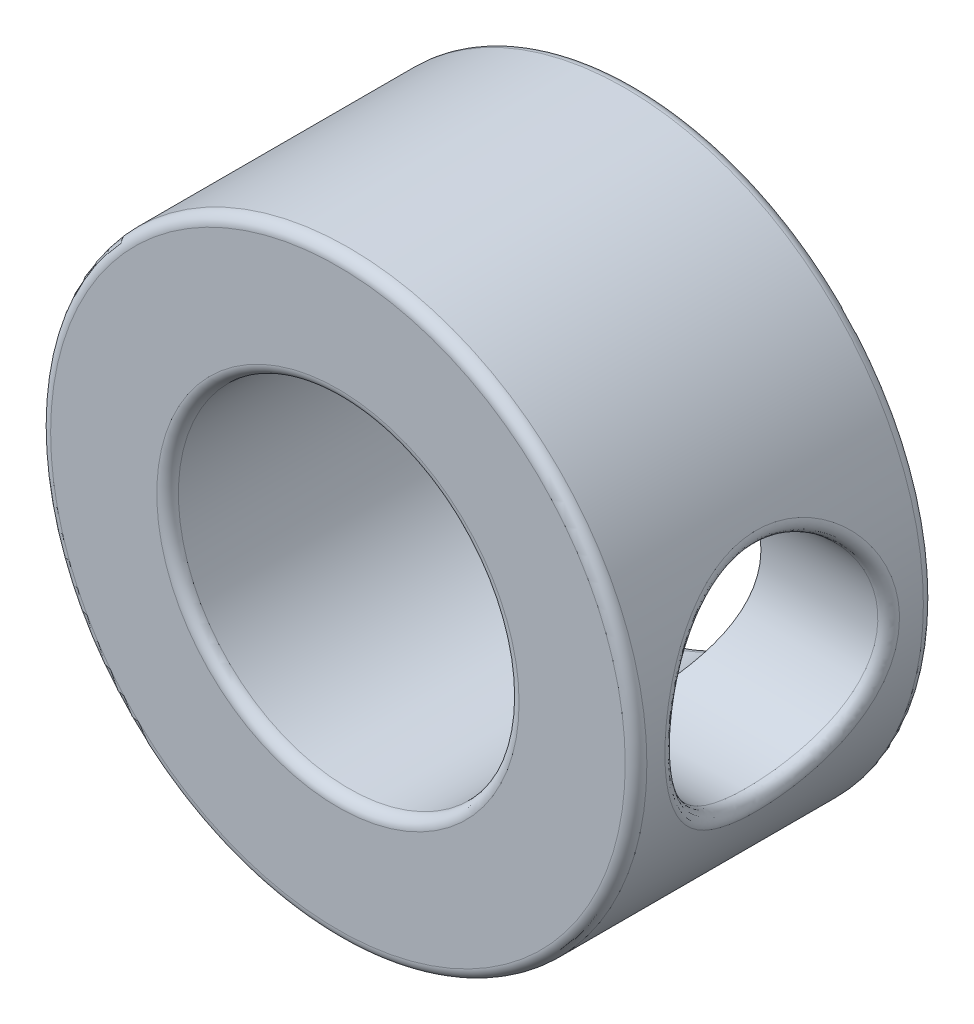
ISO-10303-21;
HEADER;
FILE_DESCRIPTION(('STEP AP214'),'2;1');
FILE_NAME('part.step','',(''),(''),'','','');
FILE_SCHEMA(('AUTOMOTIVE_DESIGN { 1 0 10303 214 1 1 1 1 }'));
ENDSEC;
DATA;
#1=APPLICATION_CONTEXT('core data for automotive mechanical design processes');
#2=APPLICATION_PROTOCOL_DEFINITION('international standard','automotive_design',2000,#1);
#3=PRODUCT_CONTEXT('',#1,'mechanical');
#4=PRODUCT('Part','Part','',(#3));
#5=PRODUCT_RELATED_PRODUCT_CATEGORY('part','',(#4));
#6=PRODUCT_DEFINITION_FORMATION('','',#4);
#7=PRODUCT_DEFINITION_CONTEXT('part definition',#1,'design');
#8=PRODUCT_DEFINITION('design','',#6,#7);
#9=PRODUCT_DEFINITION_SHAPE('','',#8);
#10=(LENGTH_UNIT() NAMED_UNIT(*) SI_UNIT(.MILLI.,.METRE.));
#11=(NAMED_UNIT(*) PLANE_ANGLE_UNIT() SI_UNIT($,.RADIAN.));
#12=(NAMED_UNIT(*) SI_UNIT($,.STERADIAN.) SOLID_ANGLE_UNIT());
#13=UNCERTAINTY_MEASURE_WITH_UNIT(LENGTH_MEASURE(1.E-05),#10,'distance_accuracy_value','');
#14=(GEOMETRIC_REPRESENTATION_CONTEXT(3) GLOBAL_UNCERTAINTY_ASSIGNED_CONTEXT((#13)) GLOBAL_UNIT_ASSIGNED_CONTEXT((#10,
#11,#12)) REPRESENTATION_CONTEXT('',''));
#15=CARTESIAN_POINT('',(0.,0.,0.));
#16=DIRECTION('',(0.,0.,1.));
#17=DIRECTION('',(1.,0.,0.));
#18=AXIS2_PLACEMENT_3D('',#15,#16,#17);
#19=CARTESIAN_POINT('',(0.,0.,7.));
#20=DIRECTION('',(0.,0.,-1.));
#21=DIRECTION('',(-1.,0.,0.));
#22=AXIS2_PLACEMENT_3D('',#19,#20,#21);
#23=CYLINDRICAL_SURFACE('',#22,7.);
#24=CARTESIAN_POINT('',(0.,0.,0.254));
#25=DIRECTION('',(0.,0.,1.));
#26=DIRECTION('',(1.,0.,0.));
#27=AXIS2_PLACEMENT_3D('',#24,#25,#26);
#28=CIRCLE('',#27,7.);
#29=CARTESIAN_POINT('',(7.,0.,0.254));
#30=VERTEX_POINT('',#29);
#31=EDGE_CURVE('E55',#30,#30,#28,.T.);
#32=ORIENTED_EDGE('',*,*,#31,.T.);
#33=EDGE_LOOP('',(#32));
#34=FACE_BOUND('',#33,.T.);
#35=CARTESIAN_POINT('',(6.74599500718785,-0.00745052319217011,6.06868885091597));
#36=CARTESIAN_POINT('',(6.99999574017009,-0.00775954974410198,6.06868792994807));
#37=CARTESIAN_POINT('',(6.99999481919878,-0.00851652453884966,6.32268772294422));
#38=CARTESIAN_POINT('',(6.74617475967984,0.124835557051628,6.06908603325106));
#39=CARTESIAN_POINT('',(7.00015029726477,0.129996553392197,6.06912102237102));
#40=CARTESIAN_POINT('',(7.00018133973748,0.142696701630731,6.3231252590001));
#41=CARTESIAN_POINT('',(6.74158726593411,0.257138676457775,6.05894232636427));
#42=CARTESIAN_POINT('',(6.99620204426195,0.268263544874281,6.05805018324804));
#43=CARTESIAN_POINT('',(6.99542111789747,0.293929404881043,6.31195095148874));
#44=CARTESIAN_POINT('',(6.72336696868249,0.51796736376721,6.01801328992543));
#45=CARTESIAN_POINT('',(6.98070532023795,0.539434260967655,6.01378548108198));
#46=CARTESIAN_POINT('',(6.97651479107329,0.592076777707847,6.2668635248723));
#47=CARTESIAN_POINT('',(6.70973425932946,0.646492970976585,5.98722817523252));
#48=CARTESIAN_POINT('',(6.96905385138901,0.673211414765891,5.9802946376337));
#49=CARTESIAN_POINT('',(6.96236878378703,0.738991492214241,6.23295064245604));
#50=CARTESIAN_POINT('',(6.67488718618503,0.895641365868597,5.90641205385684));
#51=CARTESIAN_POINT('',(6.93969470639737,0.930822749563901,5.89325259534693));
#52=CARTESIAN_POINT('',(6.92620965063367,1.0237873869586,6.1439236029936));
#53=CARTESIAN_POINT('',(6.65371315904884,1.0163022341838,5.85648333489822));
#54=CARTESIAN_POINT('',(6.92185087117704,1.05535651916526,5.83928119657562));
#55=CARTESIAN_POINT('',(6.90423838017585,1.16171209630641,6.08892212610444));
#56=CARTESIAN_POINT('',(6.6057714185031,1.24769503560081,5.73897851180741));
#57=CARTESIAN_POINT('',(6.88211239867013,1.29232379734476,5.7136332367024));
#58=CARTESIAN_POINT('',(6.85449154014115,1.42621197381462,5.95947881276385));
#59=CARTESIAN_POINT('',(6.57900217679618,1.35842424409875,5.67139758482478));
#60=CARTESIAN_POINT('',(6.86004485319853,1.4050874357702,5.64131528531973));
#61=CARTESIAN_POINT('',(6.82671438472362,1.55278402754198,5.88503166346038));
#62=CARTESIAN_POINT('',(6.5205215210907,1.57419408066983,5.51567064642374));
#63=CARTESIAN_POINT('',(6.81271803529845,1.62297603822272,5.47655206606691));
#64=CARTESIAN_POINT('',(6.76603181822603,1.7994256470997,5.71348286781811));
#65=CARTESIAN_POINT('',(6.48860662258537,1.67845672308211,5.42650960014164));
#66=CARTESIAN_POINT('',(6.78724795362709,1.72702345494025,5.38254609222411));
#67=CARTESIAN_POINT('',(6.73291526099035,1.91860591510053,5.6152630590727));
#68=CARTESIAN_POINT('',(6.42438106198946,1.87100876780006,5.23243747361491));
#69=CARTESIAN_POINT('',(6.73717149168276,1.91705858818845,5.18089223688708));
#70=CARTESIAN_POINT('',(6.6662714833269,2.13870780212069,5.40147320412166));
#71=CARTESIAN_POINT('',(6.39207032568824,1.959295124427,5.12752339721305));
#72=CARTESIAN_POINT('',(6.71256141759241,2.00262980438805,5.0727308721005));
#73=CARTESIAN_POINT('',(6.63274418589464,2.23962593969365,5.28589985734921));
#74=CARTESIAN_POINT('',(6.32889385178657,2.1217524317245,4.89866429381252));
#75=CARTESIAN_POINT('',(6.66560180273846,2.15834307381071,4.84036127620799));
#76=CARTESIAN_POINT('',(6.56718899560713,2.42532721322455,5.03378866860229));
#77=CARTESIAN_POINT('',(6.29817739564418,2.19501531889687,4.77403695059395));
#78=CARTESIAN_POINT('',(6.64362419557387,2.22658487236328,4.71570405049089));
#79=CARTESIAN_POINT('',(6.53531600488906,2.50907236231971,4.89649918707927));
#80=CARTESIAN_POINT('',(6.24388924712907,2.31931825672073,4.51296567506265));
#81=CARTESIAN_POINT('',(6.60569010857351,2.34119239282023,4.45884047450859));
#82=CARTESIAN_POINT('',(6.47898380199066,2.65116023890917,4.60890306945685));
#83=CARTESIAN_POINT('',(6.22031437578095,2.37036819957907,4.37652703526003));
#84=CARTESIAN_POINT('',(6.59002471989581,2.38657651134753,4.32726568521363));
#85=CARTESIAN_POINT('',(6.45452129114008,2.70951427396128,4.45860226358661));
#86=CARTESIAN_POINT('',(6.18443495506598,2.44648660381233,4.10174893341213));
#87=CARTESIAN_POINT('',(6.56646973377402,2.45406169565333,4.06538174986361));
#88=CARTESIAN_POINT('',(6.41729094068764,2.79652350017296,4.15590670606387));
#89=CARTESIAN_POINT('',(6.17169115057216,2.47257372249908,3.96374086415235));
#90=CARTESIAN_POINT('',(6.55851676118021,2.47636827780138,3.93639698656297));
#91=CARTESIAN_POINT('',(6.40406730716027,2.82634309546813,4.00387701670436));
#92=CARTESIAN_POINT('',(6.15766921177718,2.50122485455607,3.68486046772902));
#93=CARTESIAN_POINT('',(6.54967575846336,2.50114505644535,3.67598561658126));
#94=CARTESIAN_POINT('',(6.38951741511152,2.85909355645748,3.69666237147258));
#95=CARTESIAN_POINT('',(6.15638468851681,2.50380197560913,3.54398978049621));
#96=CARTESIAN_POINT('',(6.54889559300078,2.50331269470183,3.54620428905899));
#97=CARTESIAN_POINT('',(6.38818452707417,2.86203940524739,3.54147922214803));
#98=CARTESIAN_POINT('',(6.1651070380662,2.48603935445717,3.2746787343628));
#99=CARTESIAN_POINT('',(6.55437547449423,2.48798274806516,3.29526602006163));
#100=CARTESIAN_POINT('',(6.39723529001491,2.841735354777,3.2448061732119));
#101=CARTESIAN_POINT('',(6.1742743784216,2.46740368417212,3.14609842257639));
#102=CARTESIAN_POINT('',(6.56005216042953,2.47211484934405,3.17562681530749));
#103=CARTESIAN_POINT('',(6.4067477985146,2.8204333415852,3.10316210150116));
#104=CARTESIAN_POINT('',(6.20138390650727,2.41072447929529,2.89409390223644));
#105=CARTESIAN_POINT('',(6.57758781055965,2.42231644182766,2.9371742612308));
#106=CARTESIAN_POINT('',(6.43487805302736,2.75564462452112,2.8255539214169));
#107=CARTESIAN_POINT('',(6.21932758337659,2.37267765103672,2.7706705725611));
#108=CARTESIAN_POINT('',(6.58927757185712,2.38887370377212,2.81944326096926));
#109=CARTESIAN_POINT('',(6.45349734424847,2.71215415573282,2.68959078121563));
#110=CARTESIAN_POINT('',(6.26222723364642,2.27780627372992,2.53015586629475));
#111=CARTESIAN_POINT('',(6.61849348003791,2.30280261946681,2.58586322850734));
#112=CARTESIAN_POINT('',(6.49801224945904,2.60370883016066,2.42463978031987));
#113=CARTESIAN_POINT('',(6.28728606495165,2.22070395816155,2.41318990153409));
#114=CARTESIAN_POINT('',(6.63589035507322,2.25056918971535,2.47070456879037));
#115=CARTESIAN_POINT('',(6.52401459414781,2.53843646474901,2.29579007329759));
#116=CARTESIAN_POINT('',(6.3416585099399,2.08942092923613,2.18988126567253));
#117=CARTESIAN_POINT('',(6.67510160460914,2.1271223426441,2.24745348401034));
#118=CARTESIAN_POINT('',(6.58043426728775,2.38836980384995,2.04979327961299));
#119=CARTESIAN_POINT('',(6.37098096087515,2.01520455145277,2.08356145337705));
#120=CARTESIAN_POINT('',(6.69674840371695,2.05655735327754,2.1395475499105));
#121=CARTESIAN_POINT('',(6.61086076573207,2.30353474116384,1.93267137421085));
#122=CARTESIAN_POINT('',(6.43343249771855,1.84480773973347,1.87572392768188));
#123=CARTESIAN_POINT('',(6.74411825987406,1.8912921744444,1.92659638429398));
#124=CARTESIAN_POINT('',(6.67566372436518,2.10875799993064,1.70371755549261));
#125=CARTESIAN_POINT('',(6.46667761147503,1.74733594364443,1.77529099385522));
#126=CARTESIAN_POINT('',(6.7699990339024,1.79552738530894,1.82194128843529));
#127=CARTESIAN_POINT('',(6.71016058103963,1.99734019450898,1.59308063535066));
#128=CARTESIAN_POINT('',(6.53119381084308,1.53691236177982,1.59200129199734));
#129=CARTESIAN_POINT('',(6.8211957011239,1.58560315000032,1.6298738203169));
#130=CARTESIAN_POINT('',(6.77710594054297,1.75680975759809,1.3911686994337));
#131=CARTESIAN_POINT('',(6.5624681942855,1.42398749721672,1.50911458216153));
#132=CARTESIAN_POINT('',(6.84658403266685,1.47173295808384,1.54176157863926));
#133=CARTESIAN_POINT('',(6.80955786537196,1.62772789913789,1.29986069976655));
#134=CARTESIAN_POINT('',(6.62061378808573,1.18187117689607,1.36102488677929));
#135=CARTESIAN_POINT('',(6.89421870321587,1.22552771362536,1.38427664388087));
#136=CARTESIAN_POINT('',(6.86989275375105,1.35097020976519,1.13672509106809));
#137=CARTESIAN_POINT('',(6.64734657699712,1.05232834001264,1.29634790721505));
#138=CARTESIAN_POINT('',(6.91658186689089,1.09248734208336,1.31454214264466));
#139=CARTESIAN_POINT('',(6.89763208401371,1.2028927230358,1.06547693022575));
#140=CARTESIAN_POINT('',(6.69231708846353,0.782948669364743,1.19005678385437));
#141=CARTESIAN_POINT('',(6.95425779269201,0.814861516780464,1.20034172997105));
#142=CARTESIAN_POINT('',(6.9442958225435,0.894970914572305,0.94838662852038));
#143=CARTESIAN_POINT('',(6.71055666020419,0.643114084056474,1.14843761942041));
#144=CARTESIAN_POINT('',(6.96981502692394,0.669556407186583,1.15506838439948));
#145=CARTESIAN_POINT('',(6.9632221496217,0.735129162997615,0.902538956923043));
#146=CARTESIAN_POINT('',(6.73680606862785,0.352345857007659,1.0890557805385));
#147=CARTESIAN_POINT('',(6.99208697380478,0.367666681358566,1.09092315209673));
#148=CARTESIAN_POINT('',(6.99045989927056,0.402758579493246,0.837123923112755));
#149=CARTESIAN_POINT('',(6.74442405099234,0.201193879740451,1.07220575108179));
#150=CARTESIAN_POINT('',(6.99865558220449,0.209596000722869,1.07249675320338));
#151=CARTESIAN_POINT('',(6.99836471344446,0.229980173161718,0.818561930622809));
#152=CARTESIAN_POINT('',(6.74713114913899,-0.101743124872872,1.06618348574021));
#153=CARTESIAN_POINT('',(7.00096379225252,-0.105866174321291,1.06597773119444));
#154=CARTESIAN_POINT('',(7.00117373909926,-0.116300264732359,0.811927803109246));
#155=CARTESIAN_POINT('',(6.74222234682324,-0.253528042840974,1.0770066506804));
#156=CARTESIAN_POINT('',(6.9967263461177,-0.264692286702364,1.07782057273768));
#157=CARTESIAN_POINT('',(6.99608011086989,-0.289802171267377,0.823850601634511));
#158=CARTESIAN_POINT('',(6.72149200529628,-0.53922248002936,1.12362269747624));
#159=CARTESIAN_POINT('',(6.97911064896531,-0.561575115806109,1.12820060070728));
#160=CARTESIAN_POINT('',(6.97456923168135,-0.616373020336436,0.875202838865574));
#161=CARTESIAN_POINT('',(6.70663076600897,-0.673556609111092,1.15722122940782));
#162=CARTESIAN_POINT('',(6.966405197191,-0.701387957401834,1.1647722600233));
#163=CARTESIAN_POINT('',(6.95914843781121,-0.769927324799997,0.912214981692579));
#164=CARTESIAN_POINT('',(6.66864849181504,-0.933983941615437,1.24564474518678));
#165=CARTESIAN_POINT('',(6.93443904659647,-0.970491715946302,1.25996639981521));
#166=CARTESIAN_POINT('',(6.9197360573646,-1.0676159180523,1.0096223268494));
#167=CARTESIAN_POINT('',(6.64552756784622,-1.0600772556955,1.30046944394127));
#168=CARTESIAN_POINT('',(6.914979594771,-1.10050362248234,1.31921741678887));
#169=CARTESIAN_POINT('',(6.89574458590295,-1.21175033333107,1.0700172151209));
#170=CARTESIAN_POINT('',(6.59350314529423,-1.30049784567915,1.42924586703551));
#171=CARTESIAN_POINT('',(6.87198675319146,-1.34628099732105,1.45672817065633));
#172=CARTESIAN_POINT('',(6.84176134234895,-1.48656967160273,1.21187732303211));
#173=CARTESIAN_POINT('',(6.56461537865591,-1.41485587765908,1.50314571167821));
#174=CARTESIAN_POINT('',(6.84826886723279,-1.46242403260547,1.5356858603471));
#175=CARTESIAN_POINT('',(6.81178589454203,-1.61728975117129,1.29328539199761));
#176=CARTESIAN_POINT('',(6.50386918277736,-1.6297332580478,1.66808786962075));
#177=CARTESIAN_POINT('',(6.79942102240268,-1.67851696995995,1.70961256693629));
#178=CARTESIAN_POINT('',(6.74875248643571,-1.86291122442291,1.4749856735007));
#179=CARTESIAN_POINT('',(6.47200983119502,-1.73024828562901,1.75913551437678));
#180=CARTESIAN_POINT('',(6.77417752867175,-1.77838176646607,1.8052733264754));
#181=CARTESIAN_POINT('',(6.71569356906665,-1.97780767906576,1.57528375917045));
#182=CARTESIAN_POINT('',(6.40692715623243,-1.91974255808199,1.96101302947507));
#183=CARTESIAN_POINT('',(6.72377492933634,-1.96467319653937,2.01442378440226));
#184=CARTESIAN_POINT('',(6.64816040544583,-2.19441429585879,1.79767203021002));
#185=CARTESIAN_POINT('',(6.3737115393448,-2.00793933969999,2.07258118960323));
#186=CARTESIAN_POINT('',(6.69873676178252,-2.04958136549647,2.12889556227904));
#187=CARTESIAN_POINT('',(6.6136941558066,-2.29523004195191,1.92057551560724));
#188=CARTESIAN_POINT('',(6.31121660355488,-2.16451424582333,2.3097089874714));
#189=CARTESIAN_POINT('',(6.65283301328839,-2.19851007459131,2.36814806967412));
#190=CARTESIAN_POINT('',(6.54884616418871,-2.47420727557035,2.18179549818504));
#191=CARTESIAN_POINT('',(6.28193737406169,-2.23289192020839,2.43526894289545));
#192=CARTESIAN_POINT('',(6.63216245935035,-2.26167202387703,2.49289731944324));
#193=CARTESIAN_POINT('',(6.51846451498557,-2.55236824857337,2.32011234532636));
#194=CARTESIAN_POINT('',(6.23103621669934,-2.34748780118054,2.69710717196087));
#195=CARTESIAN_POINT('',(6.59701542948907,-2.3665454987018,2.74897711201861));
#196=CARTESIAN_POINT('',(6.46564683030446,-2.6833602081145,2.60855333896961));
#197=CARTESIAN_POINT('',(6.20940072269675,-2.39374531884327,2.83336592644063));
#198=CARTESIAN_POINT('',(6.58281808329075,-2.40735038831789,2.87955884834043));
#199=CARTESIAN_POINT('',(6.44319671790211,-2.73623613025407,2.75865598316308));
#200=CARTESIAN_POINT('',(6.17680669023856,-2.46226949879942,3.11276617530863));
#201=CARTESIAN_POINT('',(6.56160268984373,-2.46779098665268,3.14470547801618));
#202=CARTESIAN_POINT('',(6.40937545680101,-2.81456457041803,3.06644329784849));
#203=CARTESIAN_POINT('',(6.1658398427226,-2.48455483277816,3.25590222212774));
#204=CARTESIAN_POINT('',(6.55482818826294,-2.48672059387889,3.2778314813607));
#205=CARTESIAN_POINT('',(6.39799568618961,-2.84003843162355,3.22412196729825));
#206=CARTESIAN_POINT('',(6.15663637645881,-2.50328253732633,3.53277789844078));
#207=CARTESIAN_POINT('',(6.54905898419359,-2.50285154820035,3.53575300032179));
#208=CARTESIAN_POINT('',(6.38844569155543,-2.86144564709561,3.52912821285393));
#209=CARTESIAN_POINT('',(6.15746182032483,-2.50162882666783,3.66636569872854));
#210=CARTESIAN_POINT('',(6.54955890352849,-2.50146421399662,3.65892197151308));
#211=CARTESIAN_POINT('',(6.38930221498354,-2.85955532784634,3.67628853390606));
#212=CARTESIAN_POINT('',(6.16945792639263,-2.47715220828366,3.93118478341383));
#213=CARTESIAN_POINT('',(6.55710748456049,-2.48032593460818,3.906008800048));
#214=CARTESIAN_POINT('',(6.40174999773839,-2.8315766590032,3.96801323810089));
#215=CARTESIAN_POINT('',(6.18062825838362,-2.45432997626116,4.0624161428931));
#216=CARTESIAN_POINT('',(6.56406952546413,-2.46081772100361,4.02851245938795));
#217=CARTESIAN_POINT('',(6.41334091442127,-2.80548908179035,4.11257770395363));
#218=CARTESIAN_POINT('',(6.21137842948889,-2.38947746672735,4.3149607637743));
#219=CARTESIAN_POINT('',(6.58414743753973,-2.40349709288754,4.26862118448744));
#220=CARTESIAN_POINT('',(6.44524888918199,-2.73135764503108,4.39078085879962));
#221=CARTESIAN_POINT('',(6.23070077872768,-2.34803298141482,4.43645233007953));
#222=CARTESIAN_POINT('',(6.59688611147592,-2.36679415624031,4.3851955590031));
#223=CARTESIAN_POINT('',(6.46529876239056,-2.68398339129713,4.52461596847466));
#224=CARTESIAN_POINT('',(6.27554992925054,-2.24745222354262,4.67110372734068));
#225=CARTESIAN_POINT('',(6.62776095268466,-2.27492135550501,4.61435480586855));
#226=CARTESIAN_POINT('',(6.51183657052488,-2.56901180198957,4.7831079481426));
#227=CARTESIAN_POINT('',(6.30108899594309,-2.18828092255966,4.78424650412065));
#228=CARTESIAN_POINT('',(6.64570008532348,-2.22038733666388,4.72638428846945));
#229=CARTESIAN_POINT('',(6.53833723267558,-2.5013744262176,4.90774603125523));
#230=CARTESIAN_POINT('',(6.35762857067482,-2.04926340574625,5.00707361361344));
#231=CARTESIAN_POINT('',(6.68682546350685,-2.08901115510839,4.95001509200657));
#232=CARTESIAN_POINT('',(6.59700563218115,-2.34246664717305,5.15321237551024));
#233=CARTESIAN_POINT('',(6.38888260475161,-1.96828337366651,5.11599731334543));
#234=CARTESIAN_POINT('',(6.71014376359452,-2.01152447674513,5.06117178252428));
#235=CARTESIAN_POINT('',(6.62943644132025,-2.24990020419283,5.27320272336092));
#236=CARTESIAN_POINT('',(6.45217329066093,-1.7900781395532,5.31908639048794));
#237=CARTESIAN_POINT('',(6.75867198592182,-1.83745101981034,5.27048416258287));
#238=CARTESIAN_POINT('',(6.69511014446286,-2.04619783187104,5.49692565112569));
#239=CARTESIAN_POINT('',(6.48420877137918,-1.69287610799422,5.41327245162152));
#240=CARTESIAN_POINT('',(6.7838269436578,-1.74141831916768,5.36901605604669));
#241=CARTESIAN_POINT('',(6.72835182325732,-1.93508838817493,5.60068101622921));
#242=CARTESIAN_POINT('',(6.54785199975865,-1.47776578689924,5.5902749874807));
#243=CARTESIAN_POINT('',(6.83460843186344,-1.52617138737495,5.55489888302549));
#244=CARTESIAN_POINT('',(6.79439134276142,-1.68920064566645,5.79566701007047));
#245=CARTESIAN_POINT('',(6.5793136127306,-1.35895439860301,5.67204303084143));
#246=CARTESIAN_POINT('',(6.86031405996092,-1.40590587895464,5.64210306841292));
#247=CARTESIAN_POINT('',(6.827037546524,-1.55339003508995,5.88574268681738));
#248=CARTESIAN_POINT('',(6.6361333172484,-1.10811576806966,5.81432970536513));
#249=CARTESIAN_POINT('',(6.90710778928188,-1.14999419702859,5.79380528558049));
#250=CARTESIAN_POINT('',(6.88599662326902,-1.26666207020738,6.04248568774292));
#251=CARTESIAN_POINT('',(6.6614929193477,-0.976091808088085,5.8748535972255));
#252=CARTESIAN_POINT('',(6.92841931523944,-1.01402873138421,5.85919949670314));
#253=CARTESIAN_POINT('',(6.91231106368015,-1.11574846777339,6.10915880710581));
#254=CARTESIAN_POINT('',(6.70253869622148,-0.706775356303272,5.9708346683698));
#255=CARTESIAN_POINT('',(6.96292550453562,-0.735886343765747,5.96249430137413));
#256=CARTESIAN_POINT('',(6.9549022937152,-0.807898923355595,6.2148915552671));
#257=CARTESIAN_POINT('',(6.71850364139775,-0.569778514294474,6.00701934286501));
#258=CARTESIAN_POINT('',(6.9765667736721,-0.593353670941076,6.00187653307826));
#259=CARTESIAN_POINT('',(6.97146834999219,-0.651300931964338,6.25475259278984));
#260=CARTESIAN_POINT('',(6.74013288521395,-0.291009529436165,6.05572765269276));
#261=CARTESIAN_POINT('',(6.99494714884321,-0.303652518962027,6.05453269465991));
#262=CARTESIAN_POINT('',(6.99391197684194,-0.332646410802204,6.30840966699057));
#263=CARTESIAN_POINT('',(6.74580234157784,-0.14923981392762,6.06826313566702));
#264=CARTESIAN_POINT('',(6.99983005758946,-0.155431752779112,6.06822366222592));
#265=CARTESIAN_POINT('',(6.99979489933691,-0.170592655669881,6.32221875503073));
#266=CARTESIAN_POINT('',(6.74599500718785,-0.00745052319217011,6.06868885091597));
#267=CARTESIAN_POINT('',(6.99999574017009,-0.00775954974410198,6.06868792994807));
#268=CARTESIAN_POINT('',(6.99999481919878,-0.00851652453884966,6.32268772294422));
#269=(BOUNDED_SURFACE() B_SPLINE_SURFACE(3,2,((#35,#36,#37),(#38,#39,#40),(#41,#42,#43),(#44,
#45,#46),(#47,#48,#49),(#50,#51,#52),(#53,#54,#55),(#56,#57,#58),(#59,#60,#61),(#62,#63,#64),
(#65,#66,#67),(#68,#69,#70),(#71,#72,#73),(#74,#75,#76),(#77,#78,#79),(#80,#81,#82),(#83,#84,
#85),(#86,#87,#88),(#89,#90,#91),(#92,#93,#94),(#95,#96,#97),(#98,#99,#100),(#101,#102,#103),
(#104,#105,#106),(#107,#108,#109),(#110,#111,#112),(#113,#114,#115),(#116,#117,#118),(#119,#120,
#121),(#122,#123,#124),(#125,#126,#127),(#128,#129,#130),(#131,#132,#133),(#134,#135,#136),
(#137,#138,#139),(#140,#141,#142),(#143,#144,#145),(#146,#147,#148),(#149,#150,#151),(#152,#153,
#154),(#155,#156,#157),(#158,#159,#160),(#161,#162,#163),(#164,#165,#166),(#167,#168,#169),
(#170,#171,#172),(#173,#174,#175),(#176,#177,#178),(#179,#180,#181),(#182,#183,#184),(#185,#186,
#187),(#188,#189,#190),(#191,#192,#193),(#194,#195,#196),(#197,#198,#199),(#200,#201,#202),
(#203,#204,#205),(#206,#207,#208),(#209,#210,#211),(#212,#213,#214),(#215,#216,#217),(#218,#219,
#220),(#221,#222,#223),(#224,#225,#226),(#227,#228,#229),(#230,#231,#232),(#233,#234,#235),
(#236,#237,#238),(#239,#240,#241),(#242,#243,#244),(#245,#246,#247),(#248,#249,#250),(#251,#252,
#253),(#254,#255,#256),(#257,#258,#259),(#260,#261,#262),(#263,#264,#265),(#266,#267,#268)),
.UNSPECIFIED.,.T.,.F.,.F.) B_SPLINE_SURFACE_WITH_KNOTS((4,2,2,2,2,2,2,2,2,2,2,2,2,2,2,2,2,2,2,2,
2,2,2,2,2,2,2,2,2,2,2,2,2,2,2,2,2,2,4),(3,3),(0.,0.436616810043615,0.873229075355682,
1.30754024050505,1.74197019038331,2.20332697972452,2.6647716285144,3.14891684545277,
3.63284623424639,4.09605974524803,4.55901498199568,4.98725261406854,5.415562933273,
5.85041117348327,6.28617392787169,6.75719873633258,7.22741316561278,7.71007081162142,
8.19262332180471,8.69254543860062,9.19238447572818,9.64985416661589,10.10731771335,
10.5635499463519,11.0199242622801,11.4981433065655,11.9763732110389,12.4537500361167,
12.9307547675031,13.3700460472666,13.8093233052526,14.2356569769021,14.6628387093622,
15.1191205922529,15.5747562430553,16.0582737001037,16.5416713389272,17.0098885967449,
17.4778712273071),(0.,1.),
.UNSPECIFIED.) GEOMETRIC_REPRESENTATION_ITEM() RATIONAL_B_SPLINE_SURFACE(((1.,0.70710549924999,
1.),(1.,0.707151568530498,1.),(1.,0.705975624734945,1.),(1.,0.701283628903925,1.),(1.,
0.697767601226703,1.),(1.,0.688713643561791,1.),(1.,0.683186467373548,1.),(1.,0.670548544346412,
1.),(1.,0.663437364812117,1.),(1.,0.647715924673652,1.),(1.,0.639040067527608,1.),(1.,
0.621330679623231,1.),(1.,0.612297081065213,1.),(1.,0.594376364174896,1.),(1.,0.585518314131266,
1.),(1.,0.569656233245094,1.),(1.,0.562651377655683,1.),(1.,0.551904461755357,1.),(1.,
0.548035565219873,1.),(1.,0.543775285565567,1.),(1.,0.543381964690145,1.),(1.,0.546035672268308,
1.),(1.,0.548826916445673,1.),(1.,0.556991158361137,1.),(1.,0.562364594234069,1.),(1.,
0.575034241456198,1.),(1.,0.582358550884671,1.),(1.,0.598014867817442,1.),(1.,0.606348962181879,
1.),(1.,0.623849145608059,1.),(1.,0.633027987487577,1.),(1.,0.650610136612476,1.),(1.,
0.659014750964707,1.),(1.,0.674487032562705,1.),(1.,0.681513434763292,1.),(1.,0.693257601027773,
1.),(1.,0.697975867641794,1.),(1.,0.70474910033594,1.),(1.,0.706702086935443,1.),(1.,
0.707397267540246,1.),(1.,0.706139995077893,1.),(1.,0.700799992520881,1.),(1.,0.696965798957721,
1.),(1.,0.687086993882189,1.),(1.,0.681042412058044,1.),(1.,0.667294266031852,1.),(1.,
0.659595210955953,1.),(1.,0.643195395244086,1.),(1.,0.634494323396907,1.),(1.,0.616464804495979,
1.),(1.,0.607126262957643,1.),(1.,0.589293918734176,1.),(1.,0.580800135237587,1.),(1.,
0.565851822760202,1.),(1.,0.559393683129774,1.),(1.,0.549598509415139,1.),(1.,0.546259046493656,
1.),(1.,0.543458178401868,1.),(1.,0.543711037007515,1.),(1.,0.547357894491815,1.),(1.,
0.550751793107875,1.),(1.,0.559982648840777,1.),(1.,0.565744673006537,1.),(1.,0.578931672709206,
1.),(1.,0.586359933380944,1.),(1.,0.602565618446056,1.),(1.,0.611400478677536,1.),(1.,
0.629033894526001,1.),(1.,0.637832483839317,1.),(1.,0.655101397237921,1.),(1.,0.663518686449487,
1.),(1.,0.678577046345812,1.),(1.,0.685218556670185,1.),(1.,0.695907063616265,1.),(1.,
0.700028987340292,1.),(1.,0.705602847288845,1.),(1.,0.707056120429513,1.),(1.,0.70710549924999,1.))) REPRESENTATION_ITEM('') SURFACE());
#270=CARTESIAN_POINT('',(6.99999481919878,-0.00851652453884966,6.32268772294422));
#271=CARTESIAN_POINT('',(7.00018133973748,0.142696701630731,6.3231252590001));
#272=CARTESIAN_POINT('',(6.99542111789747,0.293929404881042,6.31195095148874));
#273=CARTESIAN_POINT('',(6.97651479107329,0.592076777707847,6.2668635248723));
#274=CARTESIAN_POINT('',(6.96236878378703,0.738991492214241,6.23295064245604));
#275=CARTESIAN_POINT('',(6.92620965063367,1.0237873869586,6.1439236029936));
#276=CARTESIAN_POINT('',(6.90423838017585,1.16171209630641,6.08892212610444));
#277=CARTESIAN_POINT('',(6.85449154014115,1.42621197381462,5.95947881276386));
#278=CARTESIAN_POINT('',(6.82671438472362,1.55278402754198,5.88503166346038));
#279=CARTESIAN_POINT('',(6.76603181822603,1.7994256470997,5.71348286781811));
#280=CARTESIAN_POINT('',(6.73291526099035,1.91860591510053,5.6152630590727));
#281=CARTESIAN_POINT('',(6.6662714833269,2.13870780212069,5.40147320412166));
#282=CARTESIAN_POINT('',(6.63274418589464,2.23962593969365,5.28589985734921));
#283=CARTESIAN_POINT('',(6.56718899560713,2.42532721322455,5.03378866860229));
#284=CARTESIAN_POINT('',(6.53531600488906,2.50907236231971,4.89649918707927));
#285=CARTESIAN_POINT('',(6.47898380199066,2.65116023890917,4.60890306945685));
#286=CARTESIAN_POINT('',(6.45452129114008,2.70951427396128,4.45860226358661));
#287=CARTESIAN_POINT('',(6.41729094068764,2.79652350017296,4.15590670606387));
#288=CARTESIAN_POINT('',(6.40406730716027,2.82634309546813,4.00387701670436));
#289=CARTESIAN_POINT('',(6.38951741511152,2.85909355645748,3.69666237147258));
#290=CARTESIAN_POINT('',(6.38818452707417,2.86203940524739,3.54147922214803));
#291=CARTESIAN_POINT('',(6.39723529001491,2.841735354777,3.2448061732119));
#292=CARTESIAN_POINT('',(6.4067477985146,2.8204333415852,3.10316210150116));
#293=CARTESIAN_POINT('',(6.43487805302736,2.75564462452112,2.82555392141691));
#294=CARTESIAN_POINT('',(6.45349734424847,2.71215415573282,2.68959078121563));
#295=CARTESIAN_POINT('',(6.49801224945904,2.60370883016066,2.42463978031987));
#296=CARTESIAN_POINT('',(6.52401459414781,2.53843646474901,2.29579007329759));
#297=CARTESIAN_POINT('',(6.58043426728775,2.38836980384995,2.04979327961299));
#298=CARTESIAN_POINT('',(6.61086076573207,2.30353474116384,1.93267137421085));
#299=CARTESIAN_POINT('',(6.67566372436518,2.10875799993064,1.70371755549261));
#300=CARTESIAN_POINT('',(6.71016058103963,1.99734019450898,1.59308063535066));
#301=CARTESIAN_POINT('',(6.77710594054297,1.75680975759809,1.3911686994337));
#302=CARTESIAN_POINT('',(6.80955786537196,1.62772789913789,1.29986069976655));
#303=CARTESIAN_POINT('',(6.86989275375105,1.35097020976519,1.13672509106809));
#304=CARTESIAN_POINT('',(6.89763208401371,1.2028927230358,1.06547693022575));
#305=CARTESIAN_POINT('',(6.9442958225435,0.894970914572305,0.94838662852038));
#306=CARTESIAN_POINT('',(6.9632221496217,0.735129162997615,0.902538956923043));
#307=CARTESIAN_POINT('',(6.99045989927056,0.402758579493246,0.837123923112755));
#308=CARTESIAN_POINT('',(6.99836471344446,0.229980173161719,0.818561930622809));
#309=CARTESIAN_POINT('',(7.00117373909926,-0.116300264732359,0.811927803109246));
#310=CARTESIAN_POINT('',(6.99608011086989,-0.289802171267378,0.823850601634511));
#311=CARTESIAN_POINT('',(6.97456923168135,-0.616373020336436,0.875202838865574));
#312=CARTESIAN_POINT('',(6.95914843781121,-0.769927324799996,0.912214981692579));
#313=CARTESIAN_POINT('',(6.9197360573646,-1.0676159180523,1.0096223268494));
#314=CARTESIAN_POINT('',(6.89574458590295,-1.21175033333107,1.0700172151209));
#315=CARTESIAN_POINT('',(6.84176134234895,-1.48656967160273,1.21187732303211));
#316=CARTESIAN_POINT('',(6.81178589454203,-1.61728975117129,1.29328539199761));
#317=CARTESIAN_POINT('',(6.74875248643571,-1.86291122442291,1.4749856735007));
#318=CARTESIAN_POINT('',(6.71569356906665,-1.97780767906576,1.57528375917045));
#319=CARTESIAN_POINT('',(6.64816040544583,-2.19441429585879,1.79767203021002));
#320=CARTESIAN_POINT('',(6.6136941558066,-2.29523004195191,1.92057551560724));
#321=CARTESIAN_POINT('',(6.54884616418871,-2.47420727557035,2.18179549818504));
#322=CARTESIAN_POINT('',(6.51846451498557,-2.55236824857337,2.32011234532636));
#323=CARTESIAN_POINT('',(6.46564683030446,-2.6833602081145,2.60855333896961));
#324=CARTESIAN_POINT('',(6.44319671790211,-2.73623613025407,2.75865598316308));
#325=CARTESIAN_POINT('',(6.40937545680101,-2.81456457041803,3.06644329784849));
#326=CARTESIAN_POINT('',(6.39799568618961,-2.84003843162355,3.22412196729825));
#327=CARTESIAN_POINT('',(6.38844569155543,-2.86144564709561,3.52912821285393));
#328=CARTESIAN_POINT('',(6.38930221498354,-2.85955532784634,3.67628853390606));
#329=CARTESIAN_POINT('',(6.40174999773839,-2.8315766590032,3.96801323810089));
#330=CARTESIAN_POINT('',(6.41334091442127,-2.80548908179035,4.11257770395363));
#331=CARTESIAN_POINT('',(6.44524888918199,-2.73135764503108,4.39078085879962));
#332=CARTESIAN_POINT('',(6.46529876239056,-2.68398339129713,4.52461596847466));
#333=CARTESIAN_POINT('',(6.51183657052488,-2.56901180198957,4.7831079481426));
#334=CARTESIAN_POINT('',(6.53833723267558,-2.5013744262176,4.90774603125523));
#335=CARTESIAN_POINT('',(6.59700563218115,-2.34246664717305,5.15321237551024));
#336=CARTESIAN_POINT('',(6.62943644132025,-2.24990020419283,5.27320272336092));
#337=CARTESIAN_POINT('',(6.69511014446286,-2.04619783187104,5.49692565112569));
#338=CARTESIAN_POINT('',(6.72835182325732,-1.93508838817493,5.60068101622921));
#339=CARTESIAN_POINT('',(6.79439134276142,-1.68920064566645,5.79566701007047));
#340=CARTESIAN_POINT('',(6.827037546524,-1.55339003508995,5.88574268681738));
#341=CARTESIAN_POINT('',(6.88599662326902,-1.26666207020738,6.04248568774292));
#342=CARTESIAN_POINT('',(6.91231106368015,-1.11574846777339,6.10915880710581));
#343=CARTESIAN_POINT('',(6.9549022937152,-0.807898923355595,6.2148915552671));
#344=CARTESIAN_POINT('',(6.97146834999219,-0.651300931964338,6.25475259278984));
#345=CARTESIAN_POINT('',(6.99391197684194,-0.332646410802204,6.30840966699057));
#346=CARTESIAN_POINT('',(6.99979489933691,-0.170592655669881,6.32221875503073));
#347=CARTESIAN_POINT('',(6.99999481919878,-0.00851652453884966,6.32268772294422));
#348=B_SPLINE_CURVE_WITH_KNOTS('',3,(#270,#271,#272,#273,#274,#275,#276,#277,#278,#279,#280,
#281,#282,#283,#284,#285,#286,#287,#288,#289,#290,#291,#292,#293,#294,#295,#296,#297,#298,#299,
#300,#301,#302,#303,#304,#305,#306,#307,#308,#309,#310,#311,#312,#313,#314,#315,#316,#317,#318,
#319,#320,#321,#322,#323,#324,#325,#326,#327,#328,#329,#330,#331,#332,#333,#334,#335,#336,#337,
#338,#339,#340,#341,#342,#343,#344,#345,#346,#347),.UNSPECIFIED.,.T.,.F.,(4,2,2,2,2,2,2,2,2,2,2,
2,2,2,2,2,2,2,2,2,2,2,2,2,2,2,2,2,2,2,2,2,2,2,2,2,2,2,4),(0.,0.436616810043615,
0.873229075355682,1.30754024050505,1.74197019038331,2.20332697972452,2.6647716285144,
3.14891684545277,3.63284623424639,4.09605974524803,4.55901498199568,4.98725261406854,
5.415562933273,5.85041117348327,6.28617392787169,6.75719873633258,7.22741316561278,
7.71007081162142,8.19262332180471,8.69254543860062,9.19238447572818,9.64985416661589,
10.10731771335,10.5635499463519,11.0199242622801,11.4981433065655,11.9763732110389,
12.4537500361167,12.9307547675031,13.3700460472666,13.8093233052526,14.2356569769021,
14.6628387093622,15.1191205922529,15.5747562430553,16.0582737001037,16.5416713389272,
17.0098885967449,17.4778712273071),.UNSPECIFIED.);
#349=CARTESIAN_POINT('',(6.99999481919878,-0.00851652453884966,6.32268772294422));
#350=VERTEX_POINT('',#349);
#351=EDGE_CURVE('E94',#350,#350,#348,.T.);
#352=ORIENTED_EDGE('',*,*,#351,.T.);
#353=EDGE_LOOP('',(#352));
#354=FACE_BOUND('',#353,.T.);
#355=CARTESIAN_POINT('',(0.,0.,6.746));
#356=DIRECTION('',(0.,0.,1.));
#357=DIRECTION('',(1.,0.,0.));
#358=AXIS2_PLACEMENT_3D('',#355,#356,#357);
#359=CIRCLE('',#358,7.);
#360=CARTESIAN_POINT('',(7.,0.,6.746));
#361=VERTEX_POINT('',#360);
#362=EDGE_CURVE('E99',#361,#361,#359,.F.);
#363=ORIENTED_EDGE('',*,*,#362,.T.);
#364=EDGE_LOOP('',(#363));
#365=FACE_BOUND('',#364,.T.);
#366=ADVANCED_FACE('F30',(#34,#354,#365),#23,.T.);
#367=CARTESIAN_POINT('',(0.,0.,0.));
#368=DIRECTION('',(0.,0.,1.));
#369=DIRECTION('',(1.,0.,0.));
#370=AXIS2_PLACEMENT_3D('',#367,#368,#369);
#371=CYLINDRICAL_SURFACE('',#370,4.);
#372=CARTESIAN_POINT('',(0.,0.,0.254));
#373=DIRECTION('',(0.,0.,1.));
#374=DIRECTION('',(1.,0.,0.));
#375=AXIS2_PLACEMENT_3D('',#372,#373,#374);
#376=CIRCLE('',#375,4.);
#377=CARTESIAN_POINT('',(4.,0.,0.254));
#378=VERTEX_POINT('',#377);
#379=EDGE_CURVE('E102',#378,#378,#376,.F.);
#380=ORIENTED_EDGE('',*,*,#379,.T.);
#381=EDGE_LOOP('',(#380));
#382=FACE_BOUND('',#381,.T.);
#383=CARTESIAN_POINT('',(0.,0.,6.746));
#384=DIRECTION('',(0.,0.,1.));
#385=DIRECTION('',(1.,0.,0.));
#386=AXIS2_PLACEMENT_3D('',#383,#384,#385);
#387=CIRCLE('',#386,4.);
#388=CARTESIAN_POINT('',(4.,0.,6.746));
#389=VERTEX_POINT('',#388);
#390=EDGE_CURVE('E105',#389,#389,#387,.T.);
#391=ORIENTED_EDGE('',*,*,#390,.T.);
#392=EDGE_LOOP('',(#391));
#393=FACE_BOUND('',#392,.T.);
#394=CARTESIAN_POINT('',(4.,0.,1.068700047));
#395=CARTESIAN_POINT('',(3.99999041333645,-0.127017474581757,1.06871052314285));
#396=CARTESIAN_POINT('',(3.99388606612896,-0.254191947857291,1.07844654678248));
#397=CARTESIAN_POINT('',(3.97004375645018,-0.504637448870876,1.11687117611093));
#398=CARTESIAN_POINT('',(3.95228362020013,-0.627900566214752,1.14559590635689));
#399=CARTESIAN_POINT('',(3.90691695580346,-0.866410855072519,1.22032289855089));
#400=CARTESIAN_POINT('',(3.8793591906298,-0.981694405787595,1.2662396545502));
#401=CARTESIAN_POINT('',(3.81669200407308,-1.20252078611106,1.37347171112309));
#402=CARTESIAN_POINT('',(3.78158341946771,-1.30806469321082,1.43478530555351));
#403=CARTESIAN_POINT('',(3.70340305886617,-1.51594834121369,1.576473198078));
#404=CARTESIAN_POINT('',(3.65991925310476,-1.61735909130448,1.6579786432762));
#405=CARTESIAN_POINT('',(3.57062701475019,-1.80597272754941,1.83513838487891));
#406=CARTESIAN_POINT('',(3.52481551371163,-1.89315618626756,1.93081169331715));
#407=CARTESIAN_POINT('',(3.42860839233761,-2.0628574296626,2.14876782386736));
#408=CARTESIAN_POINT('',(3.37843224203038,-2.14314408481113,2.27289960593777));
#409=CARTESIAN_POINT('',(3.28660398981215,-2.28147928175822,2.53582965861246));
#410=CARTESIAN_POINT('',(3.24493754931072,-2.33956537717127,2.67460265059983));
#411=CARTESIAN_POINT('',(3.18619154498306,-2.41866796897677,2.92632106937548));
#412=CARTESIAN_POINT('',(3.16553815334249,-2.44539100439655,3.03663365783874));
#413=CARTESIAN_POINT('',(3.13562718225798,-2.4836368261717,3.26131187029118));
#414=CARTESIAN_POINT('',(3.1263535103123,-2.49518107908723,3.37567153498375));
#415=CARTESIAN_POINT('',(3.12059775322398,-2.5023783196657,3.60552604825945));
#416=CARTESIAN_POINT('',(3.12414921262595,-2.49798963405444,3.72102308463278));
#417=CARTESIAN_POINT('',(3.14354808763097,-2.47352628417655,3.94932022002246));
#418=CARTESIAN_POINT('',(3.1594053584342,-2.45343904751794,4.062118082715));
#419=CARTESIAN_POINT('',(3.20065149664455,-2.39936204339501,4.27957690432487));
#420=CARTESIAN_POINT('',(3.22581432468022,-2.36570038322152,4.38436488641782));
#421=CARTESIAN_POINT('',(3.28291138175601,-2.28580364230156,4.58702240132666));
#422=CARTESIAN_POINT('',(3.3148480048629,-2.23956411451475,4.68488947173067));
#423=CARTESIAN_POINT('',(3.38909628611609,-2.12589824802525,4.89036640864879));
#424=CARTESIAN_POINT('',(3.43223158609937,-2.05612767979852,4.99638105123396));
#425=CARTESIAN_POINT('',(3.52011454698603,-1.90176106139236,5.19636112270181));
#426=CARTESIAN_POINT('',(3.56486382714942,-1.81714977363638,5.29031399387161));
#427=CARTESIAN_POINT('',(3.65959670069777,-1.61904726969794,5.479300997939));
#428=CARTESIAN_POINT('',(3.70922573802783,-1.50309441582429,5.5719559276659));
#429=CARTESIAN_POINT('',(3.8005660369318,-1.25426438835713,5.7364117718319));
#430=CARTESIAN_POINT('',(3.84228040824832,-1.1213938962875,5.80822088268071));
#431=CARTESIAN_POINT('',(3.89435977092135,-0.915775699483761,5.89604592658868));
#432=CARTESIAN_POINT('',(3.90966875484641,-0.848193532381912,5.92153425475051));
#433=CARTESIAN_POINT('',(3.93701840739747,-0.710492001429222,5.96670761566156));
#434=CARTESIAN_POINT('',(3.94906096340117,-0.640374129396595,5.98639600025));
#435=CARTESIAN_POINT('',(3.96949700069911,-0.498238976107662,6.01963412247536));
#436=CARTESIAN_POINT('',(3.977893752881,-0.426223459146705,6.03318936301585));
#437=CARTESIAN_POINT('',(3.9907876675748,-0.280965635284604,6.05394625030547));
#438=CARTESIAN_POINT('',(3.99528549621774,-0.207723540124778,6.06114898238424));
#439=CARTESIAN_POINT('',(4.00193773474001,-0.00911914472488963,6.07180925769649));
#440=CARTESIAN_POINT('',(4.00023812141921,0.116782046311055,6.06910031462077));
#441=CARTESIAN_POINT('',(3.9851831317752,0.365967790243087,6.04494028437374));
#442=CARTESIAN_POINT('',(3.97182854937687,0.489252520783933,6.02349047381155));
#443=CARTESIAN_POINT('',(3.93547975241443,0.725036210756608,5.96422135782099));
#444=CARTESIAN_POINT('',(3.91288306047694,0.837768435913117,5.92707522405934));
#445=CARTESIAN_POINT('',(3.85991402592884,1.05527817220598,5.83810757174298));
#446=CARTESIAN_POINT('',(3.82954038134598,1.16005434757481,5.78628359575475));
#447=CARTESIAN_POINT('',(3.75980013835146,1.37016762460733,5.6636694031119));
#448=CARTESIAN_POINT('',(3.71983526636205,1.47449380580975,5.59149276749535));
#449=CARTESIAN_POINT('',(3.63613942943351,1.67028541189959,5.43311224168623));
#450=CARTESIAN_POINT('',(3.5924043064124,1.76173633681133,5.34689276850387));
#451=CARTESIAN_POINT('',(3.49811738971022,1.9429483438413,5.14842984657205));
#452=CARTESIAN_POINT('',(3.44749767276871,2.03053701531177,5.03422552081816));
#453=CARTESIAN_POINT('',(3.35133526931812,2.18560703083074,4.79094836945697));
#454=CARTESIAN_POINT('',(3.30578908167003,2.25310229540231,4.66188592377678));
#455=CARTESIAN_POINT('',(3.23467062589685,2.35369541048622,4.41931564168864));
#456=CARTESIAN_POINT('',(3.20691274639655,2.39103788662382,4.30821843824041));
#457=CARTESIAN_POINT('',(3.16210064148119,2.45000212805236,4.07991365129187));
#458=CARTESIAN_POINT('',(3.14502969582784,2.47164845918313,3.96271592514982));
#459=CARTESIAN_POINT('',(3.12412653450015,2.4980276306775,3.72451939653565));
#460=CARTESIAN_POINT('',(3.12037006917302,2.50266369943779,3.60350278436594));
#461=CARTESIAN_POINT('',(3.12698130420546,2.49439551703419,3.36243803437246));
#462=CARTESIAN_POINT('',(3.13735369929442,2.4814854356491,3.2423902317992));
#463=CARTESIAN_POINT('',(3.16910781317444,2.44076541495318,3.0166403863821));
#464=CARTESIAN_POINT('',(3.18953618557256,2.41423841423525,2.91056140256048));
#465=CARTESIAN_POINT('',(3.23835067225396,2.34835232623326,2.70442981223551));
#466=CARTESIAN_POINT('',(3.26674010422693,2.3089878879623,2.60437973938263));
#467=CARTESIAN_POINT('',(3.33327802064527,2.21205409108822,2.39750664954417));
#468=CARTESIAN_POINT('',(3.3722443295161,2.15267421052395,2.29180002893016));
#469=CARTESIAN_POINT('',(3.45335449664062,2.0199988747657,2.090822592472));
#470=CARTESIAN_POINT('',(3.49550090710716,1.94669216932766,1.99556031248354));
#471=CARTESIAN_POINT('',(3.58803679424891,1.77134661591941,1.79867440171628));
#472=CARTESIAN_POINT('',(3.63840492042231,1.6664927623554,1.69953022783906));
#473=CARTESIAN_POINT('',(3.73398057128592,1.43961929458998,1.51969840137867));
#474=CARTESIAN_POINT('',(3.77918489162156,1.31758912547914,1.43902217808566));
#475=CARTESIAN_POINT('',(3.83959217260705,1.12346349280882,1.33413657054048));
#476=CARTESIAN_POINT('',(3.85851836503725,1.05679592580586,1.3018252118648));
#477=CARTESIAN_POINT('',(3.89335167375358,0.920199500597946,1.24302776561589));
#478=CARTESIAN_POINT('',(3.90926053019828,0.850272551313071,1.21653831901995));
#479=CARTESIAN_POINT('',(3.93753375610135,0.707873608468783,1.16984288098653));
#480=CARTESIAN_POINT('',(3.94990766224103,0.635409066095464,1.14961997078089));
#481=CARTESIAN_POINT('',(3.97075678379199,0.488456914389934,1.11572457741763));
#482=CARTESIAN_POINT('',(3.9792348745199,0.41397084019564,1.10204726295596));
#483=CARTESIAN_POINT('',(3.9903827169892,0.282852545327031,1.08410963053152));
#484=CARTESIAN_POINT('',(3.99398159772594,0.226501467969049,1.07833851284169));
#485=CARTESIAN_POINT('',(3.99879245424295,0.1134440504333,1.07063126258827));
#486=CARTESIAN_POINT('',(4.00000428228582,0.056737688484445,1.0686953673909));
#487=CARTESIAN_POINT('',(4.,0.,1.068700047));
#488=B_SPLINE_CURVE_WITH_KNOTS('',3,(#394,#395,#396,#397,#398,#399,#400,#401,#402,#403,#404,
#405,#406,#407,#408,#409,#410,#411,#412,#413,#414,#415,#416,#417,#418,#419,#420,#421,#422,#423,
#424,#425,#426,#427,#428,#429,#430,#431,#432,#433,#434,#435,#436,#437,#438,#439,#440,#441,#442,
#443,#444,#445,#446,#447,#448,#449,#450,#451,#452,#453,#454,#455,#456,#457,#458,#459,#460,#461,
#462,#463,#464,#465,#466,#467,#468,#469,#470,#471,#472,#473,#474,#475,#476,#477,#478,#479,#480,
#481,#482,#483,#484,#485,#486,#487),.UNSPECIFIED.,.T.,.F.,(4,2,2,2,2,2,2,2,2,2,2,2,2,2,2,2,2,2,
2,2,2,2,2,2,2,2,2,2,2,2,2,2,2,2,2,2,2,2,2,2,2,2,2,2,2,2,4),(0.,0.380824596981205,
0.76237577657551,1.14205395773868,1.52169008483305,1.93164371099133,2.34215252957529,
2.80825946981293,3.273574434615,3.61824011634765,3.96241782921377,4.30749640122636,
4.65285161752715,4.99031671467166,5.32790128166203,5.7285489264476,6.12961036670748,
6.5968435192146,7.0638927097676,7.28510967285465,7.50619854074891,7.72708864351576,
7.94794099976964,8.32363764506918,8.69930870028463,9.06028411191064,9.42131999550322,
9.81879863265298,10.2167213853151,10.6724081787832,11.1277785381118,11.4876927922505,
11.8470425260825,12.2084334630109,12.5699445120034,12.9023573395448,13.2349089031106,
13.615604417389,13.9966087795432,14.4531047307878,14.9098824352068,15.1389846312993,
15.3679542950656,15.5963002755784,15.8244774529886,15.9945782226526,16.1646895197153),.UNSPECIFIED.);
#489=CARTESIAN_POINT('',(4.,0.,1.068700047));
#490=VERTEX_POINT('',#489);
#491=EDGE_CURVE('E74',#490,#490,#488,.T.);
#492=ORIENTED_EDGE('',*,*,#491,.F.);
#493=EDGE_LOOP('',(#492));
#494=FACE_BOUND('',#493,.T.);
#495=ADVANCED_FACE('F68',(#382,#393,#494),#371,.F.);
#496=CARTESIAN_POINT('',(0.,0.,7.));
#497=DIRECTION('',(0.,0.,1.));
#498=DIRECTION('',(1.,0.,0.));
#499=AXIS2_PLACEMENT_3D('',#496,#497,#498);
#500=PLANE('',#499);
#501=CARTESIAN_POINT('',(0.,0.,7.));
#502=DIRECTION('',(0.,0.,1.));
#503=DIRECTION('',(1.,0.,0.));
#504=AXIS2_PLACEMENT_3D('',#501,#502,#503);
#505=CIRCLE('',#504,4.254);
#506=CARTESIAN_POINT('',(4.254,0.,7.));
#507=VERTEX_POINT('',#506);
#508=EDGE_CURVE('E10',#507,#507,#505,.F.);
#509=ORIENTED_EDGE('',*,*,#508,.T.);
#510=EDGE_LOOP('',(#509));
#511=FACE_BOUND('',#510,.T.);
#512=CARTESIAN_POINT('',(0.,0.,7.));
#513=DIRECTION('',(0.,0.,1.));
#514=DIRECTION('',(1.,0.,0.));
#515=AXIS2_PLACEMENT_3D('',#512,#513,#514);
#516=CIRCLE('',#515,6.746);
#517=CARTESIAN_POINT('',(6.746,0.,7.));
#518=VERTEX_POINT('',#517);
#519=EDGE_CURVE('E42',#518,#518,#516,.T.);
#520=ORIENTED_EDGE('',*,*,#519,.T.);
#521=EDGE_LOOP('',(#520));
#522=FACE_BOUND('',#521,.T.);
#523=ADVANCED_FACE('F119',(#511,#522),#500,.T.);
#524=CARTESIAN_POINT('',(0.,0.,0.));
#525=DIRECTION('',(0.,0.,1.));
#526=DIRECTION('',(1.,0.,0.));
#527=AXIS2_PLACEMENT_3D('',#524,#525,#526);
#528=PLANE('',#527);
#529=CARTESIAN_POINT('',(0.,0.,0.));
#530=DIRECTION('',(0.,0.,1.));
#531=DIRECTION('',(1.,0.,0.));
#532=AXIS2_PLACEMENT_3D('',#529,#530,#531);
#533=CIRCLE('',#532,4.254);
#534=CARTESIAN_POINT('',(4.254,0.,0.));
#535=VERTEX_POINT('',#534);
#536=EDGE_CURVE('E108',#535,#535,#533,.T.);
#537=ORIENTED_EDGE('',*,*,#536,.T.);
#538=EDGE_LOOP('',(#537));
#539=FACE_BOUND('',#538,.T.);
#540=CARTESIAN_POINT('',(0.,0.,0.));
#541=DIRECTION('',(0.,0.,1.));
#542=DIRECTION('',(1.,0.,0.));
#543=AXIS2_PLACEMENT_3D('',#540,#541,#542);
#544=CIRCLE('',#543,6.746);
#545=CARTESIAN_POINT('',(6.746,0.,0.));
#546=VERTEX_POINT('',#545);
#547=EDGE_CURVE('E110',#546,#546,#544,.F.);
#548=ORIENTED_EDGE('',*,*,#547,.T.);
#549=EDGE_LOOP('',(#548));
#550=FACE_BOUND('',#549,.T.);
#551=ADVANCED_FACE('F66',(#539,#550),#528,.F.);
#552=CARTESIAN_POINT('',(7.,0.,3.5687));
#553=DIRECTION('',(-1.,0.,0.));
#554=DIRECTION('',(0.,0.,1.));
#555=AXIS2_PLACEMENT_3D('',#552,#553,#554);
#556=CYLINDRICAL_SURFACE('',#555,2.499999953);
#557=CARTESIAN_POINT('',(6.74599500718785,-0.00745052319217011,6.06868885091597));
#558=CARTESIAN_POINT('',(6.74580234157784,-0.14923981392762,6.06826313566701));
#559=CARTESIAN_POINT('',(6.74013288521395,-0.291009529436165,6.05572765269276));
#560=CARTESIAN_POINT('',(6.71850364139775,-0.569778514294474,6.00701934286501));
#561=CARTESIAN_POINT('',(6.70253869622149,-0.706775356303272,5.9708346683698));
#562=CARTESIAN_POINT('',(6.6614929193477,-0.976091808088085,5.8748535972255));
#563=CARTESIAN_POINT('',(6.6361333172484,-1.10811576806966,5.81432970536513));
#564=CARTESIAN_POINT('',(6.5793136127306,-1.35895439860301,5.67204303084143));
#565=CARTESIAN_POINT('',(6.54785199975865,-1.47776578689924,5.5902749874807));
#566=CARTESIAN_POINT('',(6.48420877137918,-1.69287610799422,5.41327245162152));
#567=CARTESIAN_POINT('',(6.45217329066093,-1.7900781395532,5.31908639048794));
#568=CARTESIAN_POINT('',(6.38888260475161,-1.96828337366651,5.11599731334543));
#569=CARTESIAN_POINT('',(6.35762857067482,-2.04926340574625,5.00707361361344));
#570=CARTESIAN_POINT('',(6.30108899594309,-2.18828092255966,4.78424650412065));
#571=CARTESIAN_POINT('',(6.27554992925054,-2.24745222354262,4.67110372734068));
#572=CARTESIAN_POINT('',(6.23070077872768,-2.34803298141482,4.43645233007953));
#573=CARTESIAN_POINT('',(6.21137842948889,-2.38947746672735,4.3149607637743));
#574=CARTESIAN_POINT('',(6.18062825838362,-2.45432997626116,4.0624161428931));
#575=CARTESIAN_POINT('',(6.16945792639263,-2.47715220828366,3.93118478341383));
#576=CARTESIAN_POINT('',(6.15746182032483,-2.50162882666783,3.66636569872854));
#577=CARTESIAN_POINT('',(6.15663637645881,-2.50328253732633,3.53277789844078));
#578=CARTESIAN_POINT('',(6.1658398427226,-2.48455483277816,3.25590222212774));
#579=CARTESIAN_POINT('',(6.17680669023856,-2.46226949879942,3.11276617530863));
#580=CARTESIAN_POINT('',(6.20940072269675,-2.39374531884327,2.83336592644063));
#581=CARTESIAN_POINT('',(6.23103621669934,-2.34748780118054,2.69710717196087));
#582=CARTESIAN_POINT('',(6.28193737406169,-2.23289192020839,2.43526894289545));
#583=CARTESIAN_POINT('',(6.31121660355488,-2.16451424582333,2.3097089874714));
#584=CARTESIAN_POINT('',(6.3737115393448,-2.00793933969999,2.07258118960323));
#585=CARTESIAN_POINT('',(6.40692715623243,-1.91974255808199,1.96101302947507));
#586=CARTESIAN_POINT('',(6.47200983119502,-1.73024828562901,1.75913551437678));
#587=CARTESIAN_POINT('',(6.50386918277736,-1.6297332580478,1.66808786962075));
#588=CARTESIAN_POINT('',(6.56461537865591,-1.41485587765908,1.50314571167821));
#589=CARTESIAN_POINT('',(6.59350314529423,-1.30049784567915,1.42924586703551));
#590=CARTESIAN_POINT('',(6.64552756784622,-1.0600772556955,1.30046944394127));
#591=CARTESIAN_POINT('',(6.66864849181504,-0.933983941615437,1.24564474518678));
#592=CARTESIAN_POINT('',(6.70663076600897,-0.673556609111092,1.15722122940782));
#593=CARTESIAN_POINT('',(6.72149200529628,-0.53922248002936,1.12362269747624));
#594=CARTESIAN_POINT('',(6.74222234682324,-0.253528042840975,1.0770066506804));
#595=CARTESIAN_POINT('',(6.74713114913899,-0.101743124872872,1.06618348574021));
#596=CARTESIAN_POINT('',(6.74442405099234,0.201193879740451,1.07220575108179));
#597=CARTESIAN_POINT('',(6.73680606862785,0.35234585700766,1.0890557805385));
#598=CARTESIAN_POINT('',(6.71055666020419,0.643114084056474,1.14843761942041));
#599=CARTESIAN_POINT('',(6.69231708846353,0.782948669364743,1.19005678385436));
#600=CARTESIAN_POINT('',(6.64734657699712,1.05232834001264,1.29634790721505));
#601=CARTESIAN_POINT('',(6.62061378808573,1.18187117689607,1.36102488677929));
#602=CARTESIAN_POINT('',(6.5624681942855,1.42398749721672,1.50911458216153));
#603=CARTESIAN_POINT('',(6.53119381084308,1.53691236177982,1.59200129199734));
#604=CARTESIAN_POINT('',(6.46667761147503,1.74733594364443,1.77529099385523));
#605=CARTESIAN_POINT('',(6.43343249771855,1.84480773973347,1.87572392768188));
#606=CARTESIAN_POINT('',(6.37098096087515,2.01520455145277,2.08356145337705));
#607=CARTESIAN_POINT('',(6.3416585099399,2.08942092923613,2.18988126567253));
#608=CARTESIAN_POINT('',(6.28728606495166,2.22070395816155,2.41318990153409));
#609=CARTESIAN_POINT('',(6.26222723364642,2.27780627372992,2.53015586629475));
#610=CARTESIAN_POINT('',(6.21932758337659,2.37267765103672,2.7706705725611));
#611=CARTESIAN_POINT('',(6.20138390650727,2.41072447929529,2.89409390223644));
#612=CARTESIAN_POINT('',(6.1742743784216,2.46740368417212,3.14609842257639));
#613=CARTESIAN_POINT('',(6.1651070380662,2.48603935445717,3.2746787343628));
#614=CARTESIAN_POINT('',(6.15638468851681,2.50380197560913,3.54398978049621));
#615=CARTESIAN_POINT('',(6.15766921177718,2.50122485455607,3.68486046772902));
#616=CARTESIAN_POINT('',(6.17169115057216,2.47257372249908,3.96374086415235));
#617=CARTESIAN_POINT('',(6.18443495506598,2.44648660381233,4.10174893341213));
#618=CARTESIAN_POINT('',(6.22031437578095,2.37036819957907,4.37652703526003));
#619=CARTESIAN_POINT('',(6.24388924712907,2.31931825672073,4.51296567506265));
#620=CARTESIAN_POINT('',(6.29817739564418,2.19501531889687,4.77403695059395));
#621=CARTESIAN_POINT('',(6.32889385178657,2.1217524317245,4.89866429381252));
#622=CARTESIAN_POINT('',(6.39207032568824,1.959295124427,5.12752339721305));
#623=CARTESIAN_POINT('',(6.42438106198946,1.87100876780006,5.23243747361491));
#624=CARTESIAN_POINT('',(6.48860662258537,1.67845672308211,5.42650960014164));
#625=CARTESIAN_POINT('',(6.5205215210907,1.57419408066983,5.51567064642374));
#626=CARTESIAN_POINT('',(6.57900217679618,1.35842424409875,5.67139758482478));
#627=CARTESIAN_POINT('',(6.6057714185031,1.24769503560081,5.73897851180741));
#628=CARTESIAN_POINT('',(6.65371315904884,1.0163022341838,5.85648333489822));
#629=CARTESIAN_POINT('',(6.67488718618503,0.895641365868597,5.90641205385684));
#630=CARTESIAN_POINT('',(6.70973425932946,0.646492970976585,5.98722817523252));
#631=CARTESIAN_POINT('',(6.72336696868249,0.51796736376721,6.01801328992543));
#632=CARTESIAN_POINT('',(6.74158726593411,0.257138676457775,6.05894232636427));
#633=CARTESIAN_POINT('',(6.74617475967984,0.124835557051628,6.06908603325106));
#634=CARTESIAN_POINT('',(6.74599500718785,-0.00745052319217011,6.06868885091597));
#635=B_SPLINE_CURVE_WITH_KNOTS('',3,(#557,#558,#559,#560,#561,#562,#563,#564,#565,#566,#567,
#568,#569,#570,#571,#572,#573,#574,#575,#576,#577,#578,#579,#580,#581,#582,#583,#584,#585,#586,
#587,#588,#589,#590,#591,#592,#593,#594,#595,#596,#597,#598,#599,#600,#601,#602,#603,#604,#605,
#606,#607,#608,#609,#610,#611,#612,#613,#614,#615,#616,#617,#618,#619,#620,#621,#622,#623,#624,
#625,#626,#627,#628,#629,#630,#631,#632,#633,#634),.UNSPECIFIED.,.T.,.F.,(4,2,2,2,2,2,2,2,2,2,2,
2,2,2,2,2,2,2,2,2,2,2,2,2,2,2,2,2,2,2,2,2,2,2,2,2,2,2,4),(0.,0.46798263056223,0.936199888379879,
1.4195975272034,1.90311498425182,2.35875063505421,2.81503251794496,3.24221425040502,
3.66854792205449,4.10782518004056,4.54711645980404,5.02412119119046,5.50149801626818,
5.97972792074159,6.45794696502697,6.91432128095518,7.37055351395715,7.82801706069123,
8.28548675157894,8.78532578870649,9.28524790550241,9.7678004156857,10.2504580616943,
10.7206724909745,11.1916972994354,11.6274600538238,12.0623082940341,12.4906186132386,
12.9188562453114,13.3818114820591,13.8450249930607,14.3289543818543,14.8130995987927,
15.2745442475826,15.7359010369238,16.1703309868021,16.6046421519514,17.0412544172635,
17.4778712273071),.UNSPECIFIED.);
#636=CARTESIAN_POINT('',(6.74599500718785,-0.00745052319217011,6.06868885091597));
#637=VERTEX_POINT('',#636);
#638=EDGE_CURVE('E46',#637,#637,#635,.T.);
#639=ORIENTED_EDGE('',*,*,#638,.T.);
#640=EDGE_LOOP('',(#639));
#641=FACE_BOUND('',#640,.T.);
#642=ORIENTED_EDGE('',*,*,#491,.T.);
#643=EDGE_LOOP('',(#642));
#644=FACE_BOUND('',#643,.T.);
#645=ADVANCED_FACE('F61',(#641,#644),#556,.F.);
#646=CARTESIAN_POINT('',(0.,0.,0.254));
#647=DIRECTION('',(0.,0.,1.));
#648=DIRECTION('',(1.,0.,0.));
#649=AXIS2_PLACEMENT_3D('',#646,#647,#648);
#650=TOROIDAL_SURFACE('',#649,4.254,0.254);
#651=ORIENTED_EDGE('',*,*,#379,.F.);
#652=EDGE_LOOP('',(#651));
#653=FACE_BOUND('',#652,.T.);
#654=ORIENTED_EDGE('',*,*,#536,.F.);
#655=EDGE_LOOP('',(#654));
#656=FACE_BOUND('',#655,.T.);
#657=ADVANCED_FACE('F65',(#653,#656),#650,.T.);
#658=CARTESIAN_POINT('',(0.,0.,0.254));
#659=DIRECTION('',(0.,0.,1.));
#660=DIRECTION('',(1.,0.,0.));
#661=AXIS2_PLACEMENT_3D('',#658,#659,#660);
#662=TOROIDAL_SURFACE('',#661,6.746,0.254);
#663=ORIENTED_EDGE('',*,*,#547,.F.);
#664=EDGE_LOOP('',(#663));
#665=FACE_BOUND('',#664,.T.);
#666=ORIENTED_EDGE('',*,*,#31,.F.);
#667=EDGE_LOOP('',(#666));
#668=FACE_BOUND('',#667,.T.);
#669=ADVANCED_FACE('F84',(#665,#668),#662,.T.);
#670=CARTESIAN_POINT('',(6.74599500718785,-0.00820749636272569,6.32268772294422));
#671=DIRECTION('',(0.00121664095977665,0.999994819061706,0.00298020712721955));
#672=DIRECTION('',(0.99999925988554,-0.00121664636269281,0.));
#673=AXIS2_PLACEMENT_3D('',#670,#671,#672);
#674=CIRCLE('',#673,0.254);
#675=EDGE_CURVE('',#350,#637,#674,.T.);
#676=ORIENTED_EDGE('',*,*,#351,.F.);
#677=ORIENTED_EDGE('',*,*,#638,.F.);
#678=ORIENTED_EDGE('',*,*,#675,.T.);
#679=ORIENTED_EDGE('',*,*,#675,.F.);
#680=EDGE_LOOP('',(#676,#678,#677,#679));
#681=FACE_BOUND('',#680,.T.);
#682=ADVANCED_FACE('F78',(#681),#269,.T.);
#683=CARTESIAN_POINT('',(0.,0.,6.746));
#684=DIRECTION('',(0.,0.,1.));
#685=DIRECTION('',(1.,0.,0.));
#686=AXIS2_PLACEMENT_3D('',#683,#684,#685);
#687=TOROIDAL_SURFACE('',#686,4.254,0.254);
#688=ORIENTED_EDGE('',*,*,#508,.F.);
#689=EDGE_LOOP('',(#688));
#690=FACE_BOUND('',#689,.T.);
#691=ORIENTED_EDGE('',*,*,#390,.F.);
#692=EDGE_LOOP('',(#691));
#693=FACE_BOUND('',#692,.T.);
#694=ADVANCED_FACE('F83',(#690,#693),#687,.T.);
#695=CARTESIAN_POINT('',(0.,0.,6.746));
#696=DIRECTION('',(0.,0.,1.));
#697=DIRECTION('',(1.,0.,0.));
#698=AXIS2_PLACEMENT_3D('',#695,#696,#697);
#699=TOROIDAL_SURFACE('',#698,6.746,0.254);
#700=ORIENTED_EDGE('',*,*,#362,.F.);
#701=EDGE_LOOP('',(#700));
#702=FACE_BOUND('',#701,.T.);
#703=ORIENTED_EDGE('',*,*,#519,.F.);
#704=EDGE_LOOP('',(#703));
#705=FACE_BOUND('',#704,.T.);
#706=ADVANCED_FACE('F32',(#702,#705),#699,.T.);
#707=CLOSED_SHELL('',(#366,#495,#523,#551,#645,#657,#669,#682,#694,#706));
#708=MANIFOLD_SOLID_BREP('B2',#707);
#709=ADVANCED_BREP_SHAPE_REPRESENTATION('',(#18,#708),#14);
#710=SHAPE_DEFINITION_REPRESENTATION(#9,#709);
ENDSEC;
END-ISO-10303-21;
